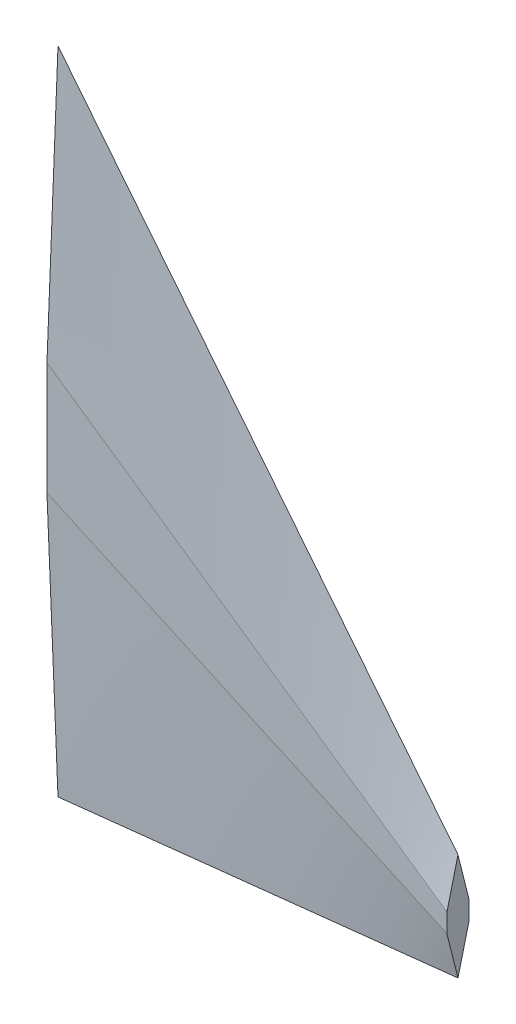
ISO-10303-21;
HEADER;
FILE_DESCRIPTION(('STEP AP214'),'2;1');
FILE_NAME('part.step','',(''),(''),'','','');
FILE_SCHEMA(('AUTOMOTIVE_DESIGN { 1 0 10303 214 1 1 1 1 }'));
ENDSEC;
DATA;
#1=APPLICATION_CONTEXT('core data for automotive mechanical design processes');
#2=APPLICATION_PROTOCOL_DEFINITION('international standard','automotive_design',2000,#1);
#3=PRODUCT_CONTEXT('',#1,'mechanical');
#4=PRODUCT('Part','Part','',(#3));
#5=PRODUCT_RELATED_PRODUCT_CATEGORY('part','',(#4));
#6=PRODUCT_DEFINITION_FORMATION('','',#4);
#7=PRODUCT_DEFINITION_CONTEXT('part definition',#1,'design');
#8=PRODUCT_DEFINITION('design','',#6,#7);
#9=PRODUCT_DEFINITION_SHAPE('','',#8);
#10=(LENGTH_UNIT() NAMED_UNIT(*) SI_UNIT(.MILLI.,.METRE.));
#11=(NAMED_UNIT(*) PLANE_ANGLE_UNIT() SI_UNIT($,.RADIAN.));
#12=(NAMED_UNIT(*) SI_UNIT($,.STERADIAN.) SOLID_ANGLE_UNIT());
#13=UNCERTAINTY_MEASURE_WITH_UNIT(LENGTH_MEASURE(1.E-05),#10,'distance_accuracy_value','');
#14=(GEOMETRIC_REPRESENTATION_CONTEXT(3) GLOBAL_UNCERTAINTY_ASSIGNED_CONTEXT((#13)) GLOBAL_UNIT_ASSIGNED_CONTEXT((#10,
#11,#12)) REPRESENTATION_CONTEXT('',''));
#15=CARTESIAN_POINT('',(0.,0.,0.));
#16=DIRECTION('',(0.,0.,1.));
#17=DIRECTION('',(1.,0.,0.));
#18=AXIS2_PLACEMENT_3D('',#15,#16,#17);
#19=CARTESIAN_POINT('',(91.39,0.,0.));
#20=DIRECTION('',(-1.,0.,0.));
#21=DIRECTION('',(0.,0.,1.));
#22=AXIS2_PLACEMENT_3D('',#19,#20,#21);
#23=PLANE('',#22);
#24=DIRECTION('',(0.,-0.969848293101963,-0.243709434300785));
#25=VECTOR('',#24,1.);
#26=CARTESIAN_POINT('',(91.39,-64.424,0.));
#27=LINE('',#26,#25);
#28=CARTESIAN_POINT('',(91.39,-54.391,2.52115384615387));
#29=VERTEX_POINT('',#28);
#30=CARTESIAN_POINT('',(91.39,-64.424,0.));
#31=VERTEX_POINT('',#30);
#32=EDGE_CURVE('E260',#29,#31,#27,.T.);
#33=ORIENTED_EDGE('',*,*,#32,.T.);
#34=DIRECTION('',(0.,0.969848293101963,-0.243709434300785));
#35=VECTOR('',#34,1.);
#36=CARTESIAN_POINT('',(91.39,-64.424,0.));
#37=LINE('',#36,#35);
#38=CARTESIAN_POINT('',(91.39,-54.391,-2.52115384615387));
#39=VERTEX_POINT('',#38);
#40=EDGE_CURVE('E12',#31,#39,#37,.T.);
#41=ORIENTED_EDGE('',*,*,#40,.T.);
#42=DIRECTION('',(0.,1.,0.));
#43=VECTOR('',#42,1.);
#44=CARTESIAN_POINT('',(91.39,-54.391,-2.52115384615387));
#45=LINE('',#44,#43);
#46=CARTESIAN_POINT('',(91.39,-50.073,-2.52115384615387));
#47=VERTEX_POINT('',#46);
#48=EDGE_CURVE('E54',#39,#47,#45,.T.);
#49=ORIENTED_EDGE('',*,*,#48,.T.);
#50=DIRECTION('',(0.,0.969848293101963,0.243709434300785));
#51=VECTOR('',#50,1.);
#52=CARTESIAN_POINT('',(91.39,-50.073,-2.52115384615387));
#53=LINE('',#52,#51);
#54=CARTESIAN_POINT('',(91.39,-40.04,0.));
#55=VERTEX_POINT('',#54);
#56=EDGE_CURVE('E294',#47,#55,#53,.T.);
#57=ORIENTED_EDGE('',*,*,#56,.T.);
#58=DIRECTION('',(0.,-0.969848293101963,0.243709434300785));
#59=VECTOR('',#58,1.);
#60=CARTESIAN_POINT('',(91.39,-50.073,2.52115384615387));
#61=LINE('',#60,#59);
#62=CARTESIAN_POINT('',(91.39,-50.073,2.52115384615387));
#63=VERTEX_POINT('',#62);
#64=EDGE_CURVE('E68',#55,#63,#61,.T.);
#65=ORIENTED_EDGE('',*,*,#64,.T.);
#66=DIRECTION('',(0.,-1.,0.));
#67=VECTOR('',#66,1.);
#68=CARTESIAN_POINT('',(91.39,-54.391,2.52115384615387));
#69=LINE('',#68,#67);
#70=EDGE_CURVE('E62',#63,#29,#69,.T.);
#71=ORIENTED_EDGE('',*,*,#70,.T.);
#72=EDGE_LOOP('',(#33,#41,#49,#57,#65,#71));
#73=FACE_BOUND('',#72,.T.);
#74=ADVANCED_FACE('F44',(#73),#23,.F.);
#75=CARTESIAN_POINT('',(0.,0.,0.));
#76=DIRECTION('',(1.,0.,0.));
#77=DIRECTION('',(0.,0.,-1.));
#78=AXIS2_PLACEMENT_3D('',#75,#76,#77);
#79=PLANE('',#78);
#80=DIRECTION('',(0.,-0.999158603528769,0.0410132295051167));
#81=VECTOR('',#80,1.);
#82=CARTESIAN_POINT('',(0.,74.29,0.));
#83=LINE('',#82,#81);
#84=CARTESIAN_POINT('',(0.,74.29,0.));
#85=VERTEX_POINT('',#84);
#86=CARTESIAN_POINT('',(0.,12.87,2.52115384615386));
#87=VERTEX_POINT('',#86);
#88=EDGE_CURVE('E105',#85,#87,#83,.T.);
#89=ORIENTED_EDGE('',*,*,#88,.F.);
#90=DIRECTION('',(0.,0.999158603528769,0.041013229505117));
#91=VECTOR('',#90,1.);
#92=CARTESIAN_POINT('',(0.,74.29,0.));
#93=LINE('',#92,#91);
#94=CARTESIAN_POINT('',(0.,12.87,-2.52115384615386));
#95=VERTEX_POINT('',#94);
#96=EDGE_CURVE('E115',#95,#85,#93,.T.);
#97=ORIENTED_EDGE('',*,*,#96,.F.);
#98=DIRECTION('',(0.,1.,0.));
#99=VECTOR('',#98,1.);
#100=CARTESIAN_POINT('',(0.,12.87,-2.52115384615386));
#101=LINE('',#100,#99);
#102=CARTESIAN_POINT('',(0.,-12.87,-2.52115384615386));
#103=VERTEX_POINT('',#102);
#104=EDGE_CURVE('E122',#103,#95,#101,.T.);
#105=ORIENTED_EDGE('',*,*,#104,.F.);
#106=DIRECTION('',(0.,0.999158603528769,-0.0410132295051168));
#107=VECTOR('',#106,1.);
#108=CARTESIAN_POINT('',(0.,-12.87,-2.52115384615386));
#109=LINE('',#108,#107);
#110=CARTESIAN_POINT('',(0.,-74.29,0.));
#111=VERTEX_POINT('',#110);
#112=EDGE_CURVE('E186',#111,#103,#109,.T.);
#113=ORIENTED_EDGE('',*,*,#112,.F.);
#114=DIRECTION('',(0.,-0.999158603528769,-0.0410132295051168));
#115=VECTOR('',#114,1.);
#116=CARTESIAN_POINT('',(0.,-12.87,2.52115384615386));
#117=LINE('',#116,#115);
#118=CARTESIAN_POINT('',(0.,-12.87,2.52115384615386));
#119=VERTEX_POINT('',#118);
#120=EDGE_CURVE('E184',#119,#111,#117,.T.);
#121=ORIENTED_EDGE('',*,*,#120,.F.);
#122=DIRECTION('',(0.,-1.,0.));
#123=VECTOR('',#122,1.);
#124=CARTESIAN_POINT('',(0.,12.87,2.52115384615386));
#125=LINE('',#124,#123);
#126=EDGE_CURVE('E128',#87,#119,#125,.T.);
#127=ORIENTED_EDGE('',*,*,#126,.F.);
#128=EDGE_LOOP('',(#89,#97,#105,#113,#121,#127));
#129=FACE_BOUND('',#128,.T.);
#130=ADVANCED_FACE('F126',(#129),#79,.F.);
#131=CARTESIAN_POINT('',(0.,12.87,-2.52115384615386));
#132=CARTESIAN_POINT('',(91.39,-50.073,-2.52115384615387));
#133=CARTESIAN_POINT('',(0.,23.1066666666667,-2.10096153846155));
#134=CARTESIAN_POINT('',(91.39,-48.4008333333334,-2.10096153846156));
#135=CARTESIAN_POINT('',(0.,33.3433333333334,-1.68076923076923));
#136=CARTESIAN_POINT('',(91.39,-46.7286666666667,-1.68076923076925));
#137=CARTESIAN_POINT('',(0.,53.8166666666667,-0.840384615384611));
#138=CARTESIAN_POINT('',(91.39,-43.3843333333334,-0.840384615384632));
#139=CARTESIAN_POINT('',(0.,64.0533333333334,-0.4201923076923));
#140=CARTESIAN_POINT('',(91.39,-41.7121666666667,-0.420192307692318));
#141=CARTESIAN_POINT('',(0.,74.29,0.));
#142=CARTESIAN_POINT('',(91.39,-40.04,0.));
#143=B_SPLINE_SURFACE_WITH_KNOTS('',3,1,((#131,#132),(#133,#134),(#135,#136),(#137,#138),(#139,
#140),(#141,#142)),.UNSPECIFIED.,.F.,.F.,.F.,(4,2,4),(2,2),(0.,0.5,1.),(0.,1.),.UNSPECIFIED.);
#144=DIRECTION('',(0.624386720645669,-0.781115371172112,0.));
#145=VECTOR('',#144,1.);
#146=CARTESIAN_POINT('',(45.695,17.125,0.));
#147=LINE('',#146,#145);
#148=EDGE_CURVE('E100',#85,#55,#147,.T.);
#149=DIRECTION('',(-0.823568875596605,0.567216278987604,0.));
#150=VECTOR('',#149,1.);
#151=CARTESIAN_POINT('',(45.695,-18.6015,-2.52115384615386));
#152=LINE('',#151,#150);
#153=EDGE_CURVE('E112',#47,#95,#152,.T.);
#154=ORIENTED_EDGE('',*,*,#96,.T.);
#155=ORIENTED_EDGE('',*,*,#148,.T.);
#156=ORIENTED_EDGE('',*,*,#56,.F.);
#157=ORIENTED_EDGE('',*,*,#153,.T.);
#158=EDGE_LOOP('',(#154,#155,#156,#157));
#159=FACE_BOUND('',#158,.T.);
#160=ADVANCED_FACE('F117',(#159),#143,.T.);
#161=CARTESIAN_POINT('',(0.,74.29,0.));
#162=CARTESIAN_POINT('',(91.39,-40.04,0.));
#163=CARTESIAN_POINT('',(0.,64.0533333333334,0.420192307692316));
#164=CARTESIAN_POINT('',(91.39,-41.7121666666663,0.420192307692219));
#165=CARTESIAN_POINT('',(0.,53.8166666666667,0.840384615384624));
#166=CARTESIAN_POINT('',(91.39,-43.3843333333328,0.840384615384485));
#167=CARTESIAN_POINT('',(0.,33.3433333333334,1.68076923076924));
#168=CARTESIAN_POINT('',(91.39,-46.7286666666661,1.68076923076911));
#169=CARTESIAN_POINT('',(0.,23.1066666666667,2.10096153846155));
#170=CARTESIAN_POINT('',(91.39,-48.400833333333,2.10096153846146));
#171=CARTESIAN_POINT('',(0.,12.87,2.52115384615386));
#172=CARTESIAN_POINT('',(91.39,-50.073,2.52115384615387));
#173=B_SPLINE_SURFACE_WITH_KNOTS('',3,1,((#161,#162),(#163,#164),(#165,#166),(#167,#168),(#169,
#170),(#171,#172)),.UNSPECIFIED.,.F.,.F.,.F.,(4,2,4),(2,2),(0.,0.5,1.),(0.,1.),.UNSPECIFIED.);
#174=DIRECTION('',(0.823568875596605,-0.567216278987604,0.));
#175=VECTOR('',#174,1.);
#176=CARTESIAN_POINT('',(45.695,-18.6015,2.52115384615386));
#177=LINE('',#176,#175);
#178=EDGE_CURVE('E111',#87,#63,#177,.T.);
#179=ORIENTED_EDGE('',*,*,#88,.T.);
#180=ORIENTED_EDGE('',*,*,#178,.T.);
#181=ORIENTED_EDGE('',*,*,#64,.F.);
#182=ORIENTED_EDGE('',*,*,#148,.F.);
#183=EDGE_LOOP('',(#179,#180,#181,#182));
#184=FACE_BOUND('',#183,.T.);
#185=ADVANCED_FACE('F102',(#184),#173,.T.);
#186=CARTESIAN_POINT('',(0.,0.,-2.52115384615386));
#187=DIRECTION('',(0.,0.,1.));
#188=DIRECTION('',(1.,0.,0.));
#189=AXIS2_PLACEMENT_3D('',#186,#187,#188);
#190=PLANE('',#189);
#191=ORIENTED_EDGE('',*,*,#153,.F.);
#192=ORIENTED_EDGE('',*,*,#48,.F.);
#193=DIRECTION('',(0.910441178771625,-0.413638562028413,0.));
#194=VECTOR('',#193,1.);
#195=CARTESIAN_POINT('',(45.695,-33.6305,-2.52115384615386));
#196=LINE('',#195,#194);
#197=EDGE_CURVE('E242',#103,#39,#196,.T.);
#198=ORIENTED_EDGE('',*,*,#197,.F.);
#199=ORIENTED_EDGE('',*,*,#104,.T.);
#200=EDGE_LOOP('',(#191,#192,#198,#199));
#201=FACE_BOUND('',#200,.T.);
#202=ADVANCED_FACE('F270',(#201),#190,.F.);
#203=CARTESIAN_POINT('',(0.,0.,2.52115384615386));
#204=DIRECTION('',(0.,0.,-1.));
#205=DIRECTION('',(-1.,0.,0.));
#206=AXIS2_PLACEMENT_3D('',#203,#204,#205);
#207=PLANE('',#206);
#208=DIRECTION('',(0.910441178771625,-0.413638562028413,0.));
#209=VECTOR('',#208,1.);
#210=CARTESIAN_POINT('',(0.,-12.87,2.52115384615386));
#211=LINE('',#210,#209);
#212=EDGE_CURVE('E243',#119,#29,#211,.T.);
#213=ORIENTED_EDGE('',*,*,#212,.T.);
#214=ORIENTED_EDGE('',*,*,#70,.F.);
#215=ORIENTED_EDGE('',*,*,#178,.F.);
#216=ORIENTED_EDGE('',*,*,#126,.T.);
#217=EDGE_LOOP('',(#213,#214,#215,#216));
#218=FACE_BOUND('',#217,.T.);
#219=ADVANCED_FACE('F216',(#218),#207,.F.);
#220=CARTESIAN_POINT('',(0.,-12.87,2.52115384615386));
#221=CARTESIAN_POINT('',(91.39,-54.391,2.52115384615387));
#222=CARTESIAN_POINT('',(0.,-23.1066666666666,2.10096153846155));
#223=CARTESIAN_POINT('',(91.39,-56.0631666666666,2.10096153846157));
#224=CARTESIAN_POINT('',(0.,-33.3433333333333,1.68076923076924));
#225=CARTESIAN_POINT('',(91.39,-57.7353333333333,1.68076923076927));
#226=CARTESIAN_POINT('',(0.,-53.8166666666666,0.840384615384623));
#227=CARTESIAN_POINT('',(91.39,-61.0796666666666,0.840384615384643));
#228=CARTESIAN_POINT('',(0.,-64.0533333333333,0.420192307692312));
#229=CARTESIAN_POINT('',(91.39,-62.7518333333333,0.420192307692325));
#230=CARTESIAN_POINT('',(0.,-74.29,0.));
#231=CARTESIAN_POINT('',(91.39,-64.424,0.));
#232=B_SPLINE_SURFACE_WITH_KNOTS('',3,1,((#220,#221),(#222,#223),(#224,#225),(#226,#227),(#228,
#229),(#230,#231)),.UNSPECIFIED.,.F.,.F.,.F.,(4,2,4),(2,2),(0.,0.5,1.),(0.,1.),.UNSPECIFIED.);
#233=DIRECTION('',(0.994223311326964,0.107331296526445,0.));
#234=VECTOR('',#233,1.);
#235=CARTESIAN_POINT('',(45.695,-69.357,0.));
#236=LINE('',#235,#234);
#237=EDGE_CURVE('E235',#111,#31,#236,.T.);
#238=ORIENTED_EDGE('',*,*,#120,.T.);
#239=ORIENTED_EDGE('',*,*,#237,.T.);
#240=ORIENTED_EDGE('',*,*,#32,.F.);
#241=ORIENTED_EDGE('',*,*,#212,.F.);
#242=EDGE_LOOP('',(#238,#239,#240,#241));
#243=FACE_BOUND('',#242,.T.);
#244=ADVANCED_FACE('F204',(#243),#232,.T.);
#245=CARTESIAN_POINT('',(0.,-74.29,0.));
#246=CARTESIAN_POINT('',(91.39,-64.424,0.));
#247=CARTESIAN_POINT('',(0.,-64.0533333333334,-0.420192307692308));
#248=CARTESIAN_POINT('',(91.39,-62.7518333333333,-0.420192307692314));
#249=CARTESIAN_POINT('',(0.,-53.8166666666667,-0.840384615384618));
#250=CARTESIAN_POINT('',(91.39,-61.0796666666666,-0.840384615384627));
#251=CARTESIAN_POINT('',(0.,-33.3433333333334,-1.68076923076924));
#252=CARTESIAN_POINT('',(91.39,-57.7353333333333,-1.68076923076925));
#253=CARTESIAN_POINT('',(0.,-23.1066666666667,-2.10096153846155));
#254=CARTESIAN_POINT('',(91.39,-56.0631666666666,-2.10096153846156));
#255=CARTESIAN_POINT('',(0.,-12.87,-2.52115384615386));
#256=CARTESIAN_POINT('',(91.39,-54.391,-2.52115384615387));
#257=B_SPLINE_SURFACE_WITH_KNOTS('',3,1,((#245,#246),(#247,#248),(#249,#250),(#251,#252),(#253,
#254),(#255,#256)),.UNSPECIFIED.,.F.,.F.,.F.,(4,2,4),(2,2),(0.,0.5,1.),(0.,1.),.UNSPECIFIED.);
#258=ORIENTED_EDGE('',*,*,#112,.T.);
#259=ORIENTED_EDGE('',*,*,#197,.T.);
#260=ORIENTED_EDGE('',*,*,#40,.F.);
#261=ORIENTED_EDGE('',*,*,#237,.F.);
#262=EDGE_LOOP('',(#258,#259,#260,#261));
#263=FACE_BOUND('',#262,.T.);
#264=ADVANCED_FACE('F215',(#263),#257,.T.);
#265=CLOSED_SHELL('',(#74,#130,#160,#185,#202,#219,#244,#264));
#266=MANIFOLD_SOLID_BREP('B2',#265);
#267=ADVANCED_BREP_SHAPE_REPRESENTATION('',(#18,#266),#14);
#268=SHAPE_DEFINITION_REPRESENTATION(#9,#267);
ENDSEC;
END-ISO-10303-21;
